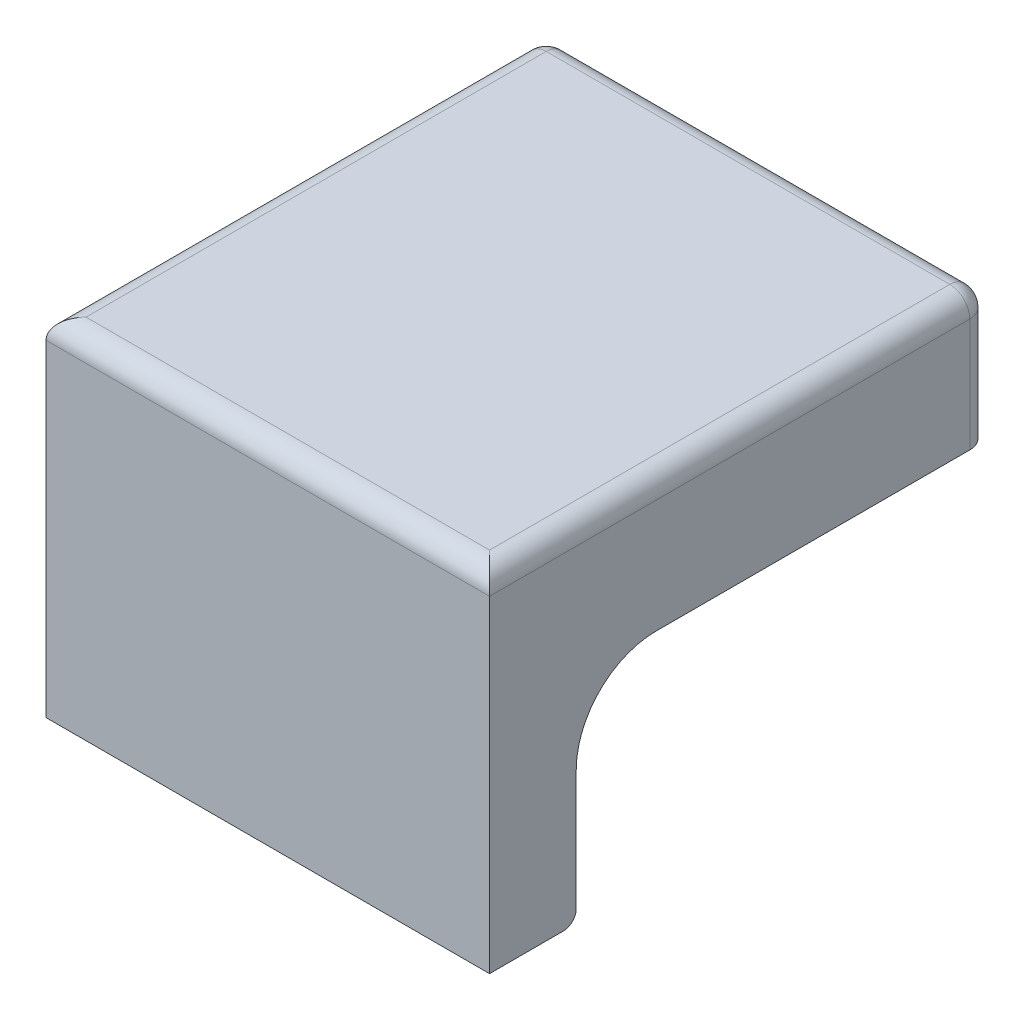
ISO-10303-21;
HEADER;
FILE_DESCRIPTION(('STEP AP214'),'2;1');
FILE_NAME('part.step','',(''),(''),'','','');
FILE_SCHEMA(('AUTOMOTIVE_DESIGN { 1 0 10303 214 1 1 1 1 }'));
ENDSEC;
DATA;
#1=APPLICATION_CONTEXT('core data for automotive mechanical design processes');
#2=APPLICATION_PROTOCOL_DEFINITION('international standard','automotive_design',2000,#1);
#3=PRODUCT_CONTEXT('',#1,'mechanical');
#4=PRODUCT('Part','Part','',(#3));
#5=PRODUCT_RELATED_PRODUCT_CATEGORY('part','',(#4));
#6=PRODUCT_DEFINITION_FORMATION('','',#4);
#7=PRODUCT_DEFINITION_CONTEXT('part definition',#1,'design');
#8=PRODUCT_DEFINITION('design','',#6,#7);
#9=PRODUCT_DEFINITION_SHAPE('','',#8);
#10=(LENGTH_UNIT() NAMED_UNIT(*) SI_UNIT(.MILLI.,.METRE.));
#11=(NAMED_UNIT(*) PLANE_ANGLE_UNIT() SI_UNIT($,.RADIAN.));
#12=(NAMED_UNIT(*) SI_UNIT($,.STERADIAN.) SOLID_ANGLE_UNIT());
#13=UNCERTAINTY_MEASURE_WITH_UNIT(LENGTH_MEASURE(1.E-05),#10,'distance_accuracy_value','');
#14=(GEOMETRIC_REPRESENTATION_CONTEXT(3) GLOBAL_UNCERTAINTY_ASSIGNED_CONTEXT((#13)) GLOBAL_UNIT_ASSIGNED_CONTEXT((#10,
#11,#12)) REPRESENTATION_CONTEXT('',''));
#15=CARTESIAN_POINT('',(0.,0.,0.));
#16=DIRECTION('',(0.,0.,1.));
#17=DIRECTION('',(1.,0.,0.));
#18=AXIS2_PLACEMENT_3D('',#15,#16,#17);
#19=CARTESIAN_POINT('',(-87.,-10.,0.));
#20=DIRECTION('',(0.,1.,0.));
#21=DIRECTION('',(0.,0.,1.));
#22=AXIS2_PLACEMENT_3D('',#19,#20,#21);
#23=PLANE('',#22);
#24=DIRECTION('',(-1.,0.,0.));
#25=VECTOR('',#24,1.);
#26=CARTESIAN_POINT('',(-43.5,-10.,0.));
#27=LINE('',#26,#25);
#28=CARTESIAN_POINT('',(-87.0437285255018,-10.,0.));
#29=VERTEX_POINT('',#28);
#30=CARTESIAN_POINT('',(-107.,-10.,0.));
#31=VERTEX_POINT('',#30);
#32=EDGE_CURVE('E207',#29,#31,#27,.T.);
#33=ORIENTED_EDGE('',*,*,#32,.F.);
#34=DIRECTION('',(0.,0.,-1.));
#35=VECTOR('',#34,1.);
#36=CARTESIAN_POINT('',(-87.0437285255018,-10.,10.));
#37=LINE('',#36,#35);
#38=CARTESIAN_POINT('',(-87.0437285255018,-10.,7.50000000000001));
#39=VERTEX_POINT('',#38);
#40=EDGE_CURVE('E190',#39,#29,#37,.T.);
#41=ORIENTED_EDGE('',*,*,#40,.F.);
#42=DIRECTION('',(1.,0.,0.));
#43=VECTOR('',#42,1.);
#44=CARTESIAN_POINT('',(-51.,-10.,7.5));
#45=LINE('',#44,#43);
#46=CARTESIAN_POINT('',(-102.5,-10.,7.50000000000001));
#47=VERTEX_POINT('',#46);
#48=EDGE_CURVE('E218',#47,#39,#45,.T.);
#49=ORIENTED_EDGE('',*,*,#48,.F.);
#50=DIRECTION('',(0.,0.,-1.));
#51=VECTOR('',#50,1.);
#52=CARTESIAN_POINT('',(-102.5,-10.,7.50000000000001));
#53=LINE('',#52,#51);
#54=CARTESIAN_POINT('',(-102.5,-10.,50.));
#55=VERTEX_POINT('',#54);
#56=EDGE_CURVE('E210',#55,#47,#53,.T.);
#57=ORIENTED_EDGE('',*,*,#56,.F.);
#58=DIRECTION('',(1.,0.,0.));
#59=VECTOR('',#58,1.);
#60=CARTESIAN_POINT('',(-87.,-10.,50.));
#61=LINE('',#60,#59);
#62=CARTESIAN_POINT('',(-110.,-10.,50.));
#63=VERTEX_POINT('',#62);
#64=EDGE_CURVE('E272',#63,#55,#61,.T.);
#65=ORIENTED_EDGE('',*,*,#64,.F.);
#66=DIRECTION('',(0.,0.,1.));
#67=VECTOR('',#66,1.);
#68=CARTESIAN_POINT('',(-110.,-10.,0.));
#69=LINE('',#68,#67);
#70=CARTESIAN_POINT('',(-110.,-10.,3.00000000000001));
#71=VERTEX_POINT('',#70);
#72=EDGE_CURVE('E206',#71,#63,#69,.T.);
#73=ORIENTED_EDGE('',*,*,#72,.F.);
#74=CARTESIAN_POINT('',(-107.,-10.,3.00000000000001));
#75=DIRECTION('',(0.,-1.,0.));
#76=DIRECTION('',(0.,0.,1.));
#77=AXIS2_PLACEMENT_3D('',#74,#75,#76);
#78=CIRCLE('',#77,3.);
#79=EDGE_CURVE('E297',#31,#71,#78,.F.);
#80=ORIENTED_EDGE('',*,*,#79,.F.);
#81=EDGE_LOOP('',(#33,#41,#49,#57,#65,#73,#80));
#82=FACE_BOUND('',#81,.T.);
#83=ADVANCED_FACE('F47',(#82),#23,.F.);
#84=CARTESIAN_POINT('',(-87.,0.,0.));
#85=DIRECTION('',(0.,1.,0.));
#86=DIRECTION('',(0.,0.,1.));
#87=AXIS2_PLACEMENT_3D('',#84,#85,#86);
#88=PLANE('',#87);
#89=DIRECTION('',(0.,0.,-1.));
#90=VECTOR('',#89,1.);
#91=CARTESIAN_POINT('',(-102.5,0.,7.50000000000001));
#92=LINE('',#91,#90);
#93=CARTESIAN_POINT('',(-102.5,0.,62.));
#94=VERTEX_POINT('',#93);
#95=CARTESIAN_POINT('',(-102.5,0.,7.50000000000001));
#96=VERTEX_POINT('',#95);
#97=EDGE_CURVE('E225',#94,#96,#92,.T.);
#98=ORIENTED_EDGE('',*,*,#97,.T.);
#99=DIRECTION('',(1.,0.,0.));
#100=VECTOR('',#99,1.);
#101=CARTESIAN_POINT('',(-51.,0.,7.5));
#102=LINE('',#101,#100);
#103=CARTESIAN_POINT('',(-51.,0.,7.5));
#104=VERTEX_POINT('',#103);
#105=EDGE_CURVE('E228',#96,#104,#102,.T.);
#106=ORIENTED_EDGE('',*,*,#105,.T.);
#107=DIRECTION('',(0.,0.,1.));
#108=VECTOR('',#107,1.);
#109=CARTESIAN_POINT('',(-51.,0.,62.));
#110=LINE('',#109,#108);
#111=CARTESIAN_POINT('',(-51.,0.,62.));
#112=VERTEX_POINT('',#111);
#113=EDGE_CURVE('E231',#104,#112,#110,.T.);
#114=ORIENTED_EDGE('',*,*,#113,.T.);
#115=DIRECTION('',(1.,0.,0.));
#116=VECTOR('',#115,1.);
#117=CARTESIAN_POINT('',(-87.,0.,62.));
#118=LINE('',#117,#116);
#119=EDGE_CURVE('E191',#94,#112,#118,.T.);
#120=ORIENTED_EDGE('',*,*,#119,.F.);
#121=EDGE_LOOP('',(#98,#106,#114,#120));
#122=FACE_BOUND('',#121,.T.);
#123=ADVANCED_FACE('F401',(#122),#88,.F.);
#124=CARTESIAN_POINT('',(-43.5,10.,62.));
#125=DIRECTION('',(0.,0.,-1.));
#126=DIRECTION('',(1.,0.,0.));
#127=AXIS2_PLACEMENT_3D('',#124,#125,#126);
#128=PLANE('',#127);
#129=DIRECTION('',(0.,-1.,0.));
#130=VECTOR('',#129,1.);
#131=CARTESIAN_POINT('',(-110.,10.,62.));
#132=LINE('',#131,#130);
#133=CARTESIAN_POINT('',(-110.,-22.,62.));
#134=VERTEX_POINT('',#133);
#135=CARTESIAN_POINT('',(-110.,-40.05,62.));
#136=VERTEX_POINT('',#135);
#137=EDGE_CURVE('E256',#134,#136,#132,.T.);
#138=ORIENTED_EDGE('',*,*,#137,.F.);
#139=DIRECTION('',(1.,0.,0.));
#140=VECTOR('',#139,1.);
#141=CARTESIAN_POINT('',(-43.5,-22.,62.));
#142=LINE('',#141,#140);
#143=CARTESIAN_POINT('',(-102.5,-22.,62.));
#144=VERTEX_POINT('',#143);
#145=EDGE_CURVE('E266',#144,#134,#142,.F.);
#146=ORIENTED_EDGE('',*,*,#145,.F.);
#147=DIRECTION('',(0.,1.,0.));
#148=VECTOR('',#147,1.);
#149=CARTESIAN_POINT('',(-102.5,-10.,62.));
#150=LINE('',#149,#148);
#151=EDGE_CURVE('E239',#144,#94,#150,.T.);
#152=ORIENTED_EDGE('',*,*,#151,.T.);
#153=ORIENTED_EDGE('',*,*,#119,.T.);
#154=DIRECTION('',(0.,1.,0.));
#155=VECTOR('',#154,1.);
#156=CARTESIAN_POINT('',(-51.,-10.,62.));
#157=LINE('',#156,#155);
#158=CARTESIAN_POINT('',(-51.,-22.,62.));
#159=VERTEX_POINT('',#158);
#160=EDGE_CURVE('E224',#159,#112,#157,.T.);
#161=ORIENTED_EDGE('',*,*,#160,.F.);
#162=DIRECTION('',(1.,0.,0.));
#163=VECTOR('',#162,1.);
#164=CARTESIAN_POINT('',(-43.5,-22.,62.));
#165=LINE('',#164,#163);
#166=CARTESIAN_POINT('',(-43.5,-22.,62.));
#167=VERTEX_POINT('',#166);
#168=EDGE_CURVE('E269',#167,#159,#165,.F.);
#169=ORIENTED_EDGE('',*,*,#168,.F.);
#170=DIRECTION('',(0.,-1.,0.));
#171=VECTOR('',#170,1.);
#172=CARTESIAN_POINT('',(-43.5,10.,62.));
#173=LINE('',#172,#171);
#174=CARTESIAN_POINT('',(-43.5,-40.05,62.));
#175=VERTEX_POINT('',#174);
#176=EDGE_CURVE('E249',#167,#175,#173,.T.);
#177=ORIENTED_EDGE('',*,*,#176,.T.);
#178=DIRECTION('',(-1.,0.,0.));
#179=VECTOR('',#178,1.);
#180=CARTESIAN_POINT('',(-43.5,-40.05,62.));
#181=LINE('',#180,#179);
#182=EDGE_CURVE('E288',#136,#175,#181,.F.);
#183=ORIENTED_EDGE('',*,*,#182,.F.);
#184=EDGE_LOOP('',(#138,#146,#152,#153,#161,#169,#177,#183));
#185=FACE_BOUND('',#184,.T.);
#186=ADVANCED_FACE('F407',(#185),#128,.T.);
#187=CARTESIAN_POINT('',(-87.,10.,0.));
#188=DIRECTION('',(0.,0.,1.));
#189=DIRECTION('',(-1.,0.,0.));
#190=AXIS2_PLACEMENT_3D('',#187,#188,#189);
#191=PLANE('',#190);
#192=DIRECTION('',(0.,-1.,0.));
#193=VECTOR('',#192,1.);
#194=CARTESIAN_POINT('',(-46.5,10.,0.));
#195=LINE('',#194,#193);
#196=CARTESIAN_POINT('',(-46.5,-10.,0.));
#197=VERTEX_POINT('',#196);
#198=CARTESIAN_POINT('',(-46.5,7.,0.));
#199=VERTEX_POINT('',#198);
#200=EDGE_CURVE('E205',#197,#199,#195,.F.);
#201=ORIENTED_EDGE('',*,*,#200,.F.);
#202=CARTESIAN_POINT('',(-54.9562714744982,-10.,0.));
#203=VERTEX_POINT('',#202);
#204=EDGE_CURVE('E184',#197,#203,#27,.T.);
#205=ORIENTED_EDGE('',*,*,#204,.T.);
#206=CARTESIAN_POINT('',(-71.,-22.,0.));
#207=DIRECTION('',(0.,0.,1.));
#208=DIRECTION('',(1.,0.,0.));
#209=AXIS2_PLACEMENT_3D('',#206,#207,#208);
#210=CIRCLE('',#209,20.035);
#211=EDGE_CURVE('E194',#203,#29,#210,.T.);
#212=ORIENTED_EDGE('',*,*,#211,.T.);
#213=ORIENTED_EDGE('',*,*,#32,.T.);
#214=DIRECTION('',(0.,-1.,0.));
#215=VECTOR('',#214,1.);
#216=CARTESIAN_POINT('',(-107.,10.,0.));
#217=LINE('',#216,#215);
#218=CARTESIAN_POINT('',(-107.,7.,0.));
#219=VERTEX_POINT('',#218);
#220=EDGE_CURVE('E295',#219,#31,#217,.T.);
#221=ORIENTED_EDGE('',*,*,#220,.F.);
#222=DIRECTION('',(1.,0.,0.));
#223=VECTOR('',#222,1.);
#224=CARTESIAN_POINT('',(-107.,7.,0.));
#225=LINE('',#224,#223);
#226=EDGE_CURVE('E328',#199,#219,#225,.F.);
#227=ORIENTED_EDGE('',*,*,#226,.F.);
#228=EDGE_LOOP('',(#201,#205,#212,#213,#221,#227));
#229=FACE_BOUND('',#228,.T.);
#230=ADVANCED_FACE('F202',(#229),#191,.F.);
#231=CARTESIAN_POINT('',(-43.5,10.,0.));
#232=DIRECTION('',(-1.,0.,0.));
#233=DIRECTION('',(0.,0.,-1.));
#234=AXIS2_PLACEMENT_3D('',#231,#232,#233);
#235=PLANE('',#234);
#236=DIRECTION('',(0.,-1.,0.));
#237=VECTOR('',#236,1.);
#238=CARTESIAN_POINT('',(-43.5,10.,75.));
#239=LINE('',#238,#237);
#240=CARTESIAN_POINT('',(-43.5,7.,75.));
#241=VERTEX_POINT('',#240);
#242=CARTESIAN_POINT('',(-43.5,-42.,75.));
#243=VERTEX_POINT('',#242);
#244=EDGE_CURVE('E250',#241,#243,#239,.T.);
#245=ORIENTED_EDGE('',*,*,#244,.T.);
#246=DIRECTION('',(0.,0.,-1.));
#247=VECTOR('',#246,1.);
#248=CARTESIAN_POINT('',(-43.5,-42.,68.));
#249=LINE('',#248,#247);
#250=CARTESIAN_POINT('',(-43.5,-42.,63.95));
#251=VERTEX_POINT('',#250);
#252=EDGE_CURVE('E241',#243,#251,#249,.T.);
#253=ORIENTED_EDGE('',*,*,#252,.T.);
#254=CARTESIAN_POINT('',(-43.5,-40.05,63.95));
#255=DIRECTION('',(1.,0.,0.));
#256=DIRECTION('',(0.,0.,-1.));
#257=AXIS2_PLACEMENT_3D('',#254,#255,#256);
#258=CIRCLE('',#257,1.95);
#259=EDGE_CURVE('E291',#175,#251,#258,.F.);
#260=ORIENTED_EDGE('',*,*,#259,.F.);
#261=ORIENTED_EDGE('',*,*,#176,.F.);
#262=CARTESIAN_POINT('',(-43.5,-22.,50.));
#263=DIRECTION('',(1.,0.,0.));
#264=DIRECTION('',(0.,0.,-1.));
#265=AXIS2_PLACEMENT_3D('',#262,#263,#264);
#266=CIRCLE('',#265,12.);
#267=CARTESIAN_POINT('',(-43.5,-10.,50.));
#268=VERTEX_POINT('',#267);
#269=EDGE_CURVE('E275',#268,#167,#266,.T.);
#270=ORIENTED_EDGE('',*,*,#269,.F.);
#271=DIRECTION('',(0.,0.,-1.));
#272=VECTOR('',#271,1.);
#273=CARTESIAN_POINT('',(-43.5,-10.,0.));
#274=LINE('',#273,#272);
#275=CARTESIAN_POINT('',(-43.5,-10.,3.00000000000001));
#276=VERTEX_POINT('',#275);
#277=EDGE_CURVE('E212',#268,#276,#274,.T.);
#278=ORIENTED_EDGE('',*,*,#277,.T.);
#279=DIRECTION('',(0.,-1.,0.));
#280=VECTOR('',#279,1.);
#281=CARTESIAN_POINT('',(-43.5,10.,3.00000000000001));
#282=LINE('',#281,#280);
#283=CARTESIAN_POINT('',(-43.5,7.,3.00000000000001));
#284=VERTEX_POINT('',#283);
#285=EDGE_CURVE('E303',#284,#276,#282,.T.);
#286=ORIENTED_EDGE('',*,*,#285,.F.);
#287=DIRECTION('',(0.,0.,1.));
#288=VECTOR('',#287,1.);
#289=CARTESIAN_POINT('',(-43.5,7.,3.00000000000001));
#290=LINE('',#289,#288);
#291=EDGE_CURVE('E322',#241,#284,#290,.F.);
#292=ORIENTED_EDGE('',*,*,#291,.F.);
#293=EDGE_LOOP('',(#245,#253,#260,#261,#270,#278,#286,#292));
#294=FACE_BOUND('',#293,.T.);
#295=ADVANCED_FACE('F363',(#294),#235,.F.);
#296=CARTESIAN_POINT('',(-110.,10.,68.));
#297=DIRECTION('',(1.,0.,0.));
#298=DIRECTION('',(0.,0.,1.));
#299=AXIS2_PLACEMENT_3D('',#296,#297,#298);
#300=PLANE('',#299);
#301=DIRECTION('',(0.,-1.,0.));
#302=VECTOR('',#301,1.);
#303=CARTESIAN_POINT('',(-110.,10.,3.00000000000002));
#304=LINE('',#303,#302);
#305=CARTESIAN_POINT('',(-110.,7.,3.00000000000002));
#306=VERTEX_POINT('',#305);
#307=EDGE_CURVE('E300',#71,#306,#304,.F.);
#308=ORIENTED_EDGE('',*,*,#307,.F.);
#309=ORIENTED_EDGE('',*,*,#72,.T.);
#310=CARTESIAN_POINT('',(-110.,-22.,50.));
#311=DIRECTION('',(-1.,0.,0.));
#312=DIRECTION('',(0.,0.,1.));
#313=AXIS2_PLACEMENT_3D('',#310,#311,#312);
#314=CIRCLE('',#313,12.);
#315=EDGE_CURVE('E282',#134,#63,#314,.T.);
#316=ORIENTED_EDGE('',*,*,#315,.F.);
#317=ORIENTED_EDGE('',*,*,#137,.T.);
#318=CARTESIAN_POINT('',(-110.,-40.05,63.95));
#319=DIRECTION('',(-1.,0.,0.));
#320=DIRECTION('',(0.,0.,1.));
#321=AXIS2_PLACEMENT_3D('',#318,#319,#320);
#322=CIRCLE('',#321,1.95);
#323=CARTESIAN_POINT('',(-110.,-42.,63.95));
#324=VERTEX_POINT('',#323);
#325=EDGE_CURVE('E286',#324,#136,#322,.F.);
#326=ORIENTED_EDGE('',*,*,#325,.F.);
#327=DIRECTION('',(0.,0.,1.));
#328=VECTOR('',#327,1.);
#329=CARTESIAN_POINT('',(-110.,-42.,62.));
#330=LINE('',#329,#328);
#331=CARTESIAN_POINT('',(-110.,-42.,75.));
#332=VERTEX_POINT('',#331);
#333=EDGE_CURVE('E244',#324,#332,#330,.T.);
#334=ORIENTED_EDGE('',*,*,#333,.T.);
#335=DIRECTION('',(0.,-1.,0.));
#336=VECTOR('',#335,1.);
#337=CARTESIAN_POINT('',(-110.,10.,75.));
#338=LINE('',#337,#336);
#339=CARTESIAN_POINT('',(-110.,7.,75.));
#340=VERTEX_POINT('',#339);
#341=EDGE_CURVE('E253',#340,#332,#338,.T.);
#342=ORIENTED_EDGE('',*,*,#341,.F.);
#343=DIRECTION('',(0.,0.,-1.));
#344=VECTOR('',#343,1.);
#345=CARTESIAN_POINT('',(-110.,7.,75.));
#346=LINE('',#345,#344);
#347=EDGE_CURVE('E11',#306,#340,#346,.F.);
#348=ORIENTED_EDGE('',*,*,#347,.F.);
#349=EDGE_LOOP('',(#308,#309,#316,#317,#326,#334,#342,#348));
#350=FACE_BOUND('',#349,.T.);
#351=ADVANCED_FACE('F438',(#350),#300,.F.);
#352=CARTESIAN_POINT('',(-87.,10.,0.));
#353=DIRECTION('',(0.,1.,0.));
#354=DIRECTION('',(0.,0.,1.));
#355=AXIS2_PLACEMENT_3D('',#352,#353,#354);
#356=PLANE('',#355);
#357=DIRECTION('',(0.,0.,1.));
#358=VECTOR('',#357,1.);
#359=CARTESIAN_POINT('',(-46.5,10.,75.));
#360=LINE('',#359,#358);
#361=CARTESIAN_POINT('',(-46.5,10.,3.00000000000001));
#362=VERTEX_POINT('',#361);
#363=CARTESIAN_POINT('',(-46.5,10.,72.));
#364=VERTEX_POINT('',#363);
#365=EDGE_CURVE('E316',#362,#364,#360,.T.);
#366=ORIENTED_EDGE('',*,*,#365,.F.);
#367=DIRECTION('',(1.,0.,0.));
#368=VECTOR('',#367,1.);
#369=CARTESIAN_POINT('',(-46.5,10.,3.00000000000001));
#370=LINE('',#369,#368);
#371=CARTESIAN_POINT('',(-107.,10.,3.00000000000001));
#372=VERTEX_POINT('',#371);
#373=EDGE_CURVE('E313',#372,#362,#370,.T.);
#374=ORIENTED_EDGE('',*,*,#373,.F.);
#375=DIRECTION('',(0.,0.,-1.));
#376=VECTOR('',#375,1.);
#377=CARTESIAN_POINT('',(-107.,10.,3.00000000000002));
#378=LINE('',#377,#376);
#379=CARTESIAN_POINT('',(-107.,10.,72.));
#380=VERTEX_POINT('',#379);
#381=EDGE_CURVE('E311',#380,#372,#378,.T.);
#382=ORIENTED_EDGE('',*,*,#381,.F.);
#383=DIRECTION('',(1.,0.,0.));
#384=VECTOR('',#383,1.);
#385=CARTESIAN_POINT('',(-87.,10.,72.));
#386=LINE('',#385,#384);
#387=EDGE_CURVE('E319',#364,#380,#386,.F.);
#388=ORIENTED_EDGE('',*,*,#387,.F.);
#389=EDGE_LOOP('',(#366,#374,#382,#388));
#390=FACE_BOUND('',#389,.T.);
#391=ADVANCED_FACE('F349',(#390),#356,.T.);
#392=CARTESIAN_POINT('',(-43.5,10.,75.));
#393=DIRECTION('',(0.,0.,1.));
#394=DIRECTION('',(-1.,0.,0.));
#395=AXIS2_PLACEMENT_3D('',#392,#393,#394);
#396=PLANE('',#395);
#397=ORIENTED_EDGE('',*,*,#341,.T.);
#398=DIRECTION('',(1.,0.,0.));
#399=VECTOR('',#398,1.);
#400=CARTESIAN_POINT('',(-43.5,-42.,75.));
#401=LINE('',#400,#399);
#402=EDGE_CURVE('E247',#332,#243,#401,.T.);
#403=ORIENTED_EDGE('',*,*,#402,.T.);
#404=ORIENTED_EDGE('',*,*,#244,.F.);
#405=DIRECTION('',(1.,0.,0.));
#406=VECTOR('',#405,1.);
#407=CARTESIAN_POINT('',(-43.5,7.,75.));
#408=LINE('',#407,#406);
#409=EDGE_CURVE('E308',#340,#241,#408,.T.);
#410=ORIENTED_EDGE('',*,*,#409,.F.);
#411=EDGE_LOOP('',(#397,#403,#404,#410));
#412=FACE_BOUND('',#411,.T.);
#413=ADVANCED_FACE('F429',(#412),#396,.T.);
#414=CARTESIAN_POINT('',(-87.,-42.,0.));
#415=DIRECTION('',(0.,1.,0.));
#416=DIRECTION('',(0.,0.,1.));
#417=AXIS2_PLACEMENT_3D('',#414,#415,#416);
#418=PLANE('',#417);
#419=CARTESIAN_POINT('',(-58.5,-42.,68.));
#420=DIRECTION('',(0.,1.,0.));
#421=DIRECTION('',(0.,0.,-1.));
#422=AXIS2_PLACEMENT_3D('',#419,#420,#421);
#423=CIRCLE('',#422,3.);
#424=CARTESIAN_POINT('',(-58.5,-42.,65.));
#425=VERTEX_POINT('',#424);
#426=EDGE_CURVE('E383',#425,#425,#423,.T.);
#427=ORIENTED_EDGE('',*,*,#426,.T.);
#428=EDGE_LOOP('',(#427));
#429=FACE_BOUND('',#428,.T.);
#430=CARTESIAN_POINT('',(-92.5,-42.,68.));
#431=DIRECTION('',(0.,1.,0.));
#432=DIRECTION('',(0.,0.,-1.));
#433=AXIS2_PLACEMENT_3D('',#430,#431,#432);
#434=CIRCLE('',#433,3.);
#435=CARTESIAN_POINT('',(-92.5,-42.,65.));
#436=VERTEX_POINT('',#435);
#437=EDGE_CURVE('E380',#436,#436,#434,.T.);
#438=ORIENTED_EDGE('',*,*,#437,.T.);
#439=EDGE_LOOP('',(#438));
#440=FACE_BOUND('',#439,.T.);
#441=ORIENTED_EDGE('',*,*,#252,.F.);
#442=ORIENTED_EDGE('',*,*,#402,.F.);
#443=ORIENTED_EDGE('',*,*,#333,.F.);
#444=DIRECTION('',(-1.,0.,0.));
#445=VECTOR('',#444,1.);
#446=CARTESIAN_POINT('',(-110.,-42.,63.95));
#447=LINE('',#446,#445);
#448=EDGE_CURVE('E284',#251,#324,#447,.T.);
#449=ORIENTED_EDGE('',*,*,#448,.F.);
#450=EDGE_LOOP('',(#441,#442,#443,#449));
#451=FACE_BOUND('',#450,.T.);
#452=ADVANCED_FACE('F425',(#429,#440,#451),#418,.F.);
#453=CARTESIAN_POINT('',(-102.5,-10.,7.50000000000001));
#454=DIRECTION('',(-1.,0.,0.));
#455=DIRECTION('',(0.,0.,-1.));
#456=AXIS2_PLACEMENT_3D('',#453,#454,#455);
#457=PLANE('',#456);
#458=ORIENTED_EDGE('',*,*,#97,.F.);
#459=ORIENTED_EDGE('',*,*,#151,.F.);
#460=CARTESIAN_POINT('',(-102.5,-22.,50.));
#461=DIRECTION('',(1.,0.,0.));
#462=DIRECTION('',(0.,0.,-1.));
#463=AXIS2_PLACEMENT_3D('',#460,#461,#462);
#464=CIRCLE('',#463,12.);
#465=EDGE_CURVE('E280',#55,#144,#464,.T.);
#466=ORIENTED_EDGE('',*,*,#465,.F.);
#467=ORIENTED_EDGE('',*,*,#56,.T.);
#468=DIRECTION('',(0.,1.,0.));
#469=VECTOR('',#468,1.);
#470=CARTESIAN_POINT('',(-102.5,-10.,7.50000000000001));
#471=LINE('',#470,#469);
#472=EDGE_CURVE('E237',#47,#96,#471,.T.);
#473=ORIENTED_EDGE('',*,*,#472,.T.);
#474=EDGE_LOOP('',(#458,#459,#466,#467,#473));
#475=FACE_BOUND('',#474,.T.);
#476=ADVANCED_FACE('F420',(#475),#457,.F.);
#477=CARTESIAN_POINT('',(-51.,-10.,7.5));
#478=DIRECTION('',(0.,0.,-1.));
#479=DIRECTION('',(1.,0.,0.));
#480=AXIS2_PLACEMENT_3D('',#477,#478,#479);
#481=PLANE('',#480);
#482=CARTESIAN_POINT('',(-54.9562714744982,-10.,7.5));
#483=VERTEX_POINT('',#482);
#484=CARTESIAN_POINT('',(-51.,-10.,7.5));
#485=VERTEX_POINT('',#484);
#486=EDGE_CURVE('E187',#483,#485,#45,.T.);
#487=ORIENTED_EDGE('',*,*,#486,.T.);
#488=DIRECTION('',(0.,1.,0.));
#489=VECTOR('',#488,1.);
#490=CARTESIAN_POINT('',(-51.,-10.,7.5));
#491=LINE('',#490,#489);
#492=EDGE_CURVE('E235',#485,#104,#491,.T.);
#493=ORIENTED_EDGE('',*,*,#492,.T.);
#494=ORIENTED_EDGE('',*,*,#105,.F.);
#495=ORIENTED_EDGE('',*,*,#472,.F.);
#496=ORIENTED_EDGE('',*,*,#48,.T.);
#497=CARTESIAN_POINT('',(-71.,-22.,7.50000000000001));
#498=DIRECTION('',(0.,0.,1.));
#499=DIRECTION('',(1.,0.,0.));
#500=AXIS2_PLACEMENT_3D('',#497,#498,#499);
#501=CIRCLE('',#500,20.035);
#502=EDGE_CURVE('E200',#483,#39,#501,.T.);
#503=ORIENTED_EDGE('',*,*,#502,.F.);
#504=EDGE_LOOP('',(#487,#493,#494,#495,#496,#503));
#505=FACE_BOUND('',#504,.T.);
#506=ADVANCED_FACE('F374',(#505),#481,.F.);
#507=CARTESIAN_POINT('',(-51.,-10.,62.));
#508=DIRECTION('',(1.,0.,0.));
#509=DIRECTION('',(0.,0.,1.));
#510=AXIS2_PLACEMENT_3D('',#507,#508,#509);
#511=PLANE('',#510);
#512=ORIENTED_EDGE('',*,*,#113,.F.);
#513=ORIENTED_EDGE('',*,*,#492,.F.);
#514=DIRECTION('',(0.,0.,1.));
#515=VECTOR('',#514,1.);
#516=CARTESIAN_POINT('',(-51.,-10.,62.));
#517=LINE('',#516,#515);
#518=CARTESIAN_POINT('',(-51.,-10.,50.));
#519=VERTEX_POINT('',#518);
#520=EDGE_CURVE('E221',#485,#519,#517,.T.);
#521=ORIENTED_EDGE('',*,*,#520,.T.);
#522=CARTESIAN_POINT('',(-51.,-22.,50.));
#523=DIRECTION('',(-1.,0.,0.));
#524=DIRECTION('',(0.,0.,1.));
#525=AXIS2_PLACEMENT_3D('',#522,#523,#524);
#526=CIRCLE('',#525,12.);
#527=EDGE_CURVE('E277',#159,#519,#526,.T.);
#528=ORIENTED_EDGE('',*,*,#527,.F.);
#529=ORIENTED_EDGE('',*,*,#160,.T.);
#530=EDGE_LOOP('',(#512,#513,#521,#528,#529));
#531=FACE_BOUND('',#530,.T.);
#532=ADVANCED_FACE('F371',(#531),#511,.F.);
#533=ORIENTED_EDGE('',*,*,#277,.F.);
#534=DIRECTION('',(1.,0.,0.));
#535=VECTOR('',#534,1.);
#536=CARTESIAN_POINT('',(-87.,-10.,50.));
#537=LINE('',#536,#535);
#538=EDGE_CURVE('E264',#519,#268,#537,.T.);
#539=ORIENTED_EDGE('',*,*,#538,.F.);
#540=ORIENTED_EDGE('',*,*,#520,.F.);
#541=ORIENTED_EDGE('',*,*,#486,.F.);
#542=DIRECTION('',(0.,0.,-1.));
#543=VECTOR('',#542,1.);
#544=CARTESIAN_POINT('',(-54.9562714744982,-10.,10.));
#545=LINE('',#544,#543);
#546=EDGE_CURVE('E179',#203,#483,#545,.F.);
#547=ORIENTED_EDGE('',*,*,#546,.F.);
#548=ORIENTED_EDGE('',*,*,#204,.F.);
#549=CARTESIAN_POINT('',(-46.5,-10.,3.00000000000001));
#550=DIRECTION('',(0.,-1.,0.));
#551=DIRECTION('',(0.,0.,1.));
#552=AXIS2_PLACEMENT_3D('',#549,#550,#551);
#553=CIRCLE('',#552,3.);
#554=EDGE_CURVE('E306',#276,#197,#553,.F.);
#555=ORIENTED_EDGE('',*,*,#554,.F.);
#556=EDGE_LOOP('',(#533,#539,#540,#541,#547,#548,#555));
#557=FACE_BOUND('',#556,.T.);
#558=ADVANCED_FACE('F182',(#557),#23,.F.);
#559=CARTESIAN_POINT('',(-71.,-22.,10.));
#560=DIRECTION('',(0.,0.,-1.));
#561=DIRECTION('',(1.,0.,0.));
#562=AXIS2_PLACEMENT_3D('',#559,#560,#561);
#563=CYLINDRICAL_SURFACE('',#562,20.035);
#564=ORIENTED_EDGE('',*,*,#502,.T.);
#565=ORIENTED_EDGE('',*,*,#40,.T.);
#566=ORIENTED_EDGE('',*,*,#211,.F.);
#567=ORIENTED_EDGE('',*,*,#546,.T.);
#568=EDGE_LOOP('',(#564,#565,#566,#567));
#569=FACE_BOUND('',#568,.T.);
#570=ADVANCED_FACE('F195',(#569),#563,.F.);
#571=CARTESIAN_POINT('',(-87.,-22.,50.));
#572=DIRECTION('',(1.,0.,0.));
#573=DIRECTION('',(0.,0.,1.));
#574=AXIS2_PLACEMENT_3D('',#571,#572,#573);
#575=CYLINDRICAL_SURFACE('',#574,12.);
#576=ORIENTED_EDGE('',*,*,#527,.T.);
#577=ORIENTED_EDGE('',*,*,#538,.T.);
#578=ORIENTED_EDGE('',*,*,#269,.T.);
#579=ORIENTED_EDGE('',*,*,#168,.T.);
#580=EDGE_LOOP('',(#576,#577,#578,#579));
#581=FACE_BOUND('',#580,.T.);
#582=ADVANCED_FACE('F366',(#581),#575,.F.);
#583=CARTESIAN_POINT('',(-87.,-22.,50.));
#584=DIRECTION('',(1.,0.,0.));
#585=DIRECTION('',(0.,0.,1.));
#586=AXIS2_PLACEMENT_3D('',#583,#584,#585);
#587=CYLINDRICAL_SURFACE('',#586,12.);
#588=ORIENTED_EDGE('',*,*,#315,.T.);
#589=ORIENTED_EDGE('',*,*,#64,.T.);
#590=ORIENTED_EDGE('',*,*,#465,.T.);
#591=ORIENTED_EDGE('',*,*,#145,.T.);
#592=EDGE_LOOP('',(#588,#589,#590,#591));
#593=FACE_BOUND('',#592,.T.);
#594=ADVANCED_FACE('F449',(#593),#587,.F.);
#595=CARTESIAN_POINT('',(-87.,-40.05,63.95));
#596=DIRECTION('',(1.,0.,0.));
#597=DIRECTION('',(0.,0.,1.));
#598=AXIS2_PLACEMENT_3D('',#595,#596,#597);
#599=CYLINDRICAL_SURFACE('',#598,1.95);
#600=ORIENTED_EDGE('',*,*,#259,.T.);
#601=ORIENTED_EDGE('',*,*,#448,.T.);
#602=ORIENTED_EDGE('',*,*,#325,.T.);
#603=ORIENTED_EDGE('',*,*,#182,.T.);
#604=EDGE_LOOP('',(#600,#601,#602,#603));
#605=FACE_BOUND('',#604,.T.);
#606=ADVANCED_FACE('F452',(#605),#599,.T.);
#607=CARTESIAN_POINT('',(-107.,10.,3.00000000000001));
#608=DIRECTION('',(0.,-1.,0.));
#609=DIRECTION('',(0.,0.,-1.));
#610=AXIS2_PLACEMENT_3D('',#607,#608,#609);
#611=CYLINDRICAL_SURFACE('',#610,3.);
#612=ORIENTED_EDGE('',*,*,#220,.T.);
#613=ORIENTED_EDGE('',*,*,#79,.T.);
#614=ORIENTED_EDGE('',*,*,#307,.T.);
#615=CARTESIAN_POINT('',(-107.,7.,3.00000000000001));
#616=DIRECTION('',(0.,1.,0.));
#617=DIRECTION('',(0.,0.,-1.));
#618=AXIS2_PLACEMENT_3D('',#615,#616,#617);
#619=CIRCLE('',#618,3.);
#620=EDGE_CURVE('E56',#219,#306,#619,.T.);
#621=ORIENTED_EDGE('',*,*,#620,.F.);
#622=EDGE_LOOP('',(#612,#613,#614,#621));
#623=FACE_BOUND('',#622,.T.);
#624=ADVANCED_FACE('F456',(#623),#611,.T.);
#625=CARTESIAN_POINT('',(-46.5,10.,3.00000000000001));
#626=DIRECTION('',(0.,-1.,0.));
#627=DIRECTION('',(0.,0.,-1.));
#628=AXIS2_PLACEMENT_3D('',#625,#626,#627);
#629=CYLINDRICAL_SURFACE('',#628,3.);
#630=ORIENTED_EDGE('',*,*,#285,.T.);
#631=ORIENTED_EDGE('',*,*,#554,.T.);
#632=ORIENTED_EDGE('',*,*,#200,.T.);
#633=CARTESIAN_POINT('',(-46.5,7.,3.00000000000001));
#634=DIRECTION('',(0.,1.,0.));
#635=DIRECTION('',(0.,0.,-1.));
#636=AXIS2_PLACEMENT_3D('',#633,#634,#635);
#637=CIRCLE('',#636,3.);
#638=EDGE_CURVE('E325',#284,#199,#637,.T.);
#639=ORIENTED_EDGE('',*,*,#638,.F.);
#640=EDGE_LOOP('',(#630,#631,#632,#639));
#641=FACE_BOUND('',#640,.T.);
#642=ADVANCED_FACE('F358',(#641),#629,.T.);
#643=CARTESIAN_POINT('',(-87.,7.,3.00000000000001));
#644=DIRECTION('',(-1.,0.,0.));
#645=DIRECTION('',(0.,0.,-1.));
#646=AXIS2_PLACEMENT_3D('',#643,#644,#645);
#647=CYLINDRICAL_SURFACE('',#646,3.);
#648=CARTESIAN_POINT('',(-107.,7.,3.00000000000001));
#649=DIRECTION('',(1.,0.,0.));
#650=DIRECTION('',(0.,0.,-1.));
#651=AXIS2_PLACEMENT_3D('',#648,#649,#650);
#652=CIRCLE('',#651,3.);
#653=EDGE_CURVE('E51',#219,#372,#652,.T.);
#654=ORIENTED_EDGE('',*,*,#653,.T.);
#655=ORIENTED_EDGE('',*,*,#373,.T.);
#656=CARTESIAN_POINT('',(-46.5,7.,3.00000000000001));
#657=DIRECTION('',(-1.,0.,0.));
#658=DIRECTION('',(0.,0.,1.));
#659=AXIS2_PLACEMENT_3D('',#656,#657,#658);
#660=CIRCLE('',#659,3.);
#661=EDGE_CURVE('E339',#362,#199,#660,.T.);
#662=ORIENTED_EDGE('',*,*,#661,.T.);
#663=ORIENTED_EDGE('',*,*,#226,.T.);
#664=EDGE_LOOP('',(#654,#655,#662,#663));
#665=FACE_BOUND('',#664,.T.);
#666=ADVANCED_FACE('F49',(#665),#647,.T.);
#667=CARTESIAN_POINT('',(-107.,7.,3.00000000000001));
#668=DIRECTION('',(0.,1.,0.));
#669=DIRECTION('',(0.,0.,1.));
#670=AXIS2_PLACEMENT_3D('',#667,#668,#669);
#671=SPHERICAL_SURFACE('',#670,3.);
#672=ORIENTED_EDGE('',*,*,#620,.T.);
#673=CARTESIAN_POINT('',(-107.,7.,3.00000000000001));
#674=DIRECTION('',(0.,0.,-1.));
#675=DIRECTION('',(-1.,0.,0.));
#676=AXIS2_PLACEMENT_3D('',#673,#674,#675);
#677=CIRCLE('',#676,3.);
#678=EDGE_CURVE('E63',#306,#372,#677,.T.);
#679=ORIENTED_EDGE('',*,*,#678,.T.);
#680=ORIENTED_EDGE('',*,*,#653,.F.);
#681=EDGE_LOOP('',(#672,#679,#680));
#682=FACE_BOUND('',#681,.T.);
#683=ADVANCED_FACE('F473',(#682),#671,.T.);
#684=CARTESIAN_POINT('',(-46.5,7.,3.00000000000001));
#685=DIRECTION('',(0.,1.,0.));
#686=DIRECTION('',(0.,0.,1.));
#687=AXIS2_PLACEMENT_3D('',#684,#685,#686);
#688=SPHERICAL_SURFACE('',#687,3.);
#689=ORIENTED_EDGE('',*,*,#661,.F.);
#690=CARTESIAN_POINT('',(-46.5,7.,3.00000000000001));
#691=DIRECTION('',(0.,0.,-1.));
#692=DIRECTION('',(-1.,0.,0.));
#693=AXIS2_PLACEMENT_3D('',#690,#691,#692);
#694=CIRCLE('',#693,3.);
#695=EDGE_CURVE('E337',#362,#284,#694,.T.);
#696=ORIENTED_EDGE('',*,*,#695,.T.);
#697=ORIENTED_EDGE('',*,*,#638,.T.);
#698=EDGE_LOOP('',(#689,#696,#697));
#699=FACE_BOUND('',#698,.T.);
#700=ADVANCED_FACE('F356',(#699),#688,.T.);
#701=CARTESIAN_POINT('',(-107.,7.,0.));
#702=DIRECTION('',(0.,0.,1.));
#703=DIRECTION('',(-1.,0.,0.));
#704=AXIS2_PLACEMENT_3D('',#701,#702,#703);
#705=CYLINDRICAL_SURFACE('',#704,3.);
#706=ORIENTED_EDGE('',*,*,#678,.F.);
#707=ORIENTED_EDGE('',*,*,#347,.T.);
#708=CARTESIAN_POINT('',(-107.,7.,72.));
#709=DIRECTION('',(-0.707106781186548,0.,-0.707106781186547));
#710=DIRECTION('',(-0.707106781186547,0.,0.707106781186548));
#711=AXIS2_PLACEMENT_3D('',#708,#709,#710);
#712=ELLIPSE('',#711,4.24264068711928,3.);
#713=EDGE_CURVE('E334',#340,#380,#712,.T.);
#714=ORIENTED_EDGE('',*,*,#713,.T.);
#715=ORIENTED_EDGE('',*,*,#381,.T.);
#716=EDGE_LOOP('',(#706,#707,#714,#715));
#717=FACE_BOUND('',#716,.T.);
#718=ADVANCED_FACE('F346',(#717),#705,.T.);
#719=CARTESIAN_POINT('',(-46.5,7.,0.));
#720=DIRECTION('',(0.,0.,-1.));
#721=DIRECTION('',(1.,0.,0.));
#722=AXIS2_PLACEMENT_3D('',#719,#720,#721);
#723=CYLINDRICAL_SURFACE('',#722,3.);
#724=ORIENTED_EDGE('',*,*,#695,.F.);
#725=ORIENTED_EDGE('',*,*,#365,.T.);
#726=CARTESIAN_POINT('',(-46.5,7.,72.));
#727=DIRECTION('',(-0.707106781186547,0.,0.707106781186548));
#728=DIRECTION('',(-0.707106781186548,0.,-0.707106781186547));
#729=AXIS2_PLACEMENT_3D('',#726,#727,#728);
#730=ELLIPSE('',#729,4.24264068711928,3.);
#731=EDGE_CURVE('E332',#364,#241,#730,.F.);
#732=ORIENTED_EDGE('',*,*,#731,.T.);
#733=ORIENTED_EDGE('',*,*,#291,.T.);
#734=EDGE_LOOP('',(#724,#725,#732,#733));
#735=FACE_BOUND('',#734,.T.);
#736=ADVANCED_FACE('F351',(#735),#723,.T.);
#737=CARTESIAN_POINT('',(-43.5,7.,72.));
#738=DIRECTION('',(1.,0.,0.));
#739=DIRECTION('',(0.,0.,1.));
#740=AXIS2_PLACEMENT_3D('',#737,#738,#739);
#741=CYLINDRICAL_SURFACE('',#740,3.);
#742=ORIENTED_EDGE('',*,*,#713,.F.);
#743=ORIENTED_EDGE('',*,*,#409,.T.);
#744=ORIENTED_EDGE('',*,*,#731,.F.);
#745=ORIENTED_EDGE('',*,*,#387,.T.);
#746=EDGE_LOOP('',(#742,#743,#744,#745));
#747=FACE_BOUND('',#746,.T.);
#748=ADVANCED_FACE('F463',(#747),#741,.T.);
#749=CARTESIAN_POINT('',(-92.5,-32.,68.));
#750=DIRECTION('',(0.,-1.,0.));
#751=DIRECTION('',(0.,0.,-1.));
#752=AXIS2_PLACEMENT_3D('',#749,#750,#751);
#753=CYLINDRICAL_SURFACE('',#752,3.);
#754=CARTESIAN_POINT('',(-92.5,-32.,68.));
#755=DIRECTION('',(0.,1.,0.));
#756=DIRECTION('',(0.,0.,-1.));
#757=AXIS2_PLACEMENT_3D('',#754,#755,#756);
#758=CIRCLE('',#757,3.);
#759=CARTESIAN_POINT('',(-92.5,-32.,65.));
#760=VERTEX_POINT('',#759);
#761=EDGE_CURVE('E377',#760,#760,#758,.T.);
#762=ORIENTED_EDGE('',*,*,#761,.T.);
#763=EDGE_LOOP('',(#762));
#764=FACE_BOUND('',#763,.T.);
#765=ORIENTED_EDGE('',*,*,#437,.F.);
#766=EDGE_LOOP('',(#765));
#767=FACE_BOUND('',#766,.T.);
#768=ADVANCED_FACE('F466',(#764,#767),#753,.F.);
#769=CARTESIAN_POINT('',(-92.5,-32.,68.));
#770=DIRECTION('',(0.,-1.,0.));
#771=DIRECTION('',(0.,0.,-1.));
#772=AXIS2_PLACEMENT_3D('',#769,#770,#771);
#773=PLANE('',#772);
#774=ORIENTED_EDGE('',*,*,#761,.F.);
#775=EDGE_LOOP('',(#774));
#776=FACE_BOUND('',#775,.T.);
#777=ADVANCED_FACE('F398',(#776),#773,.T.);
#778=CARTESIAN_POINT('',(-58.5,-32.,68.));
#779=DIRECTION('',(0.,-1.,0.));
#780=DIRECTION('',(0.,0.,-1.));
#781=AXIS2_PLACEMENT_3D('',#778,#779,#780);
#782=CYLINDRICAL_SURFACE('',#781,3.);
#783=CARTESIAN_POINT('',(-58.5,-32.,68.));
#784=DIRECTION('',(0.,1.,0.));
#785=DIRECTION('',(0.,0.,-1.));
#786=AXIS2_PLACEMENT_3D('',#783,#784,#785);
#787=CIRCLE('',#786,3.);
#788=CARTESIAN_POINT('',(-58.5,-32.,65.));
#789=VERTEX_POINT('',#788);
#790=EDGE_CURVE('E335',#789,#789,#787,.T.);
#791=ORIENTED_EDGE('',*,*,#790,.T.);
#792=EDGE_LOOP('',(#791));
#793=FACE_BOUND('',#792,.T.);
#794=ORIENTED_EDGE('',*,*,#426,.F.);
#795=EDGE_LOOP('',(#794));
#796=FACE_BOUND('',#795,.T.);
#797=ADVANCED_FACE('F389',(#793,#796),#782,.F.);
#798=CARTESIAN_POINT('',(-58.5,-32.,68.));
#799=DIRECTION('',(0.,-1.,0.));
#800=DIRECTION('',(0.,0.,-1.));
#801=AXIS2_PLACEMENT_3D('',#798,#799,#800);
#802=PLANE('',#801);
#803=ORIENTED_EDGE('',*,*,#790,.F.);
#804=EDGE_LOOP('',(#803));
#805=FACE_BOUND('',#804,.T.);
#806=ADVANCED_FACE('F392',(#805),#802,.T.);
#807=CLOSED_SHELL('',(#83,#123,#186,#230,#295,#351,#391,#413,#452,#476,#506,#532,#558,#570,#582,
#594,#606,#624,#642,#666,#683,#700,#718,#736,#748,#768,#777,#797,#806));
#808=MANIFOLD_SOLID_BREP('B2',#807);
#809=ADVANCED_BREP_SHAPE_REPRESENTATION('',(#18,#808),#14);
#810=SHAPE_DEFINITION_REPRESENTATION(#9,#809);
ENDSEC;
END-ISO-10303-21;
